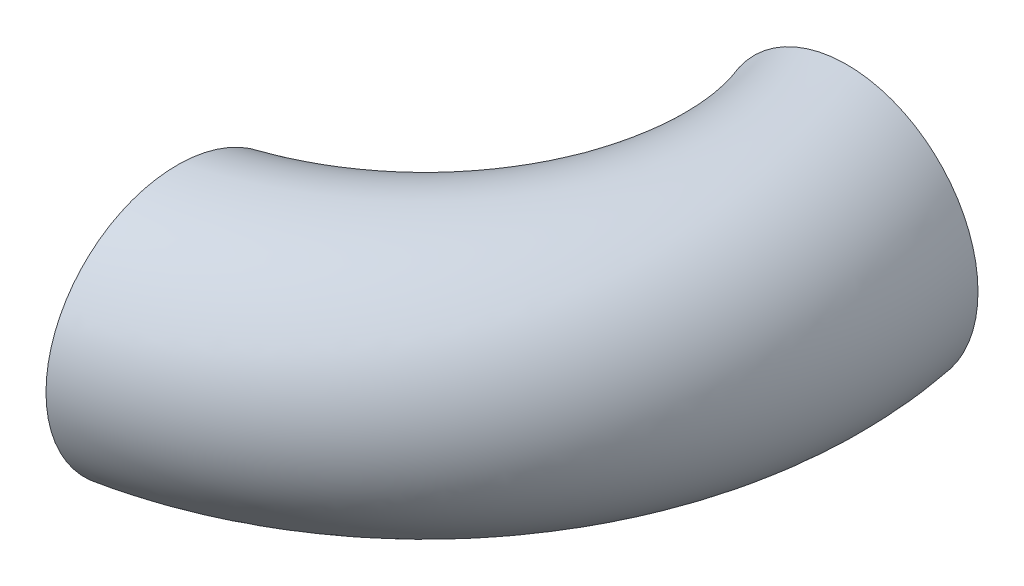
ISO-10303-21;
HEADER;
FILE_DESCRIPTION(('STEP AP214'),'2;1');
FILE_NAME('part.step','',(''),(''),'','','');
FILE_SCHEMA(('AUTOMOTIVE_DESIGN { 1 0 10303 214 1 1 1 1 }'));
ENDSEC;
DATA;
#1=APPLICATION_CONTEXT('core data for automotive mechanical design processes');
#2=APPLICATION_PROTOCOL_DEFINITION('international standard','automotive_design',2000,#1);
#3=PRODUCT_CONTEXT('',#1,'mechanical');
#4=PRODUCT('Part','Part','',(#3));
#5=PRODUCT_RELATED_PRODUCT_CATEGORY('part','',(#4));
#6=PRODUCT_DEFINITION_FORMATION('','',#4);
#7=PRODUCT_DEFINITION_CONTEXT('part definition',#1,'design');
#8=PRODUCT_DEFINITION('design','',#6,#7);
#9=PRODUCT_DEFINITION_SHAPE('','',#8);
#10=(LENGTH_UNIT() NAMED_UNIT(*) SI_UNIT(.MILLI.,.METRE.));
#11=(NAMED_UNIT(*) PLANE_ANGLE_UNIT() SI_UNIT($,.RADIAN.));
#12=(NAMED_UNIT(*) SI_UNIT($,.STERADIAN.) SOLID_ANGLE_UNIT());
#13=UNCERTAINTY_MEASURE_WITH_UNIT(LENGTH_MEASURE(1.E-05),#10,'distance_accuracy_value','');
#14=(GEOMETRIC_REPRESENTATION_CONTEXT(3) GLOBAL_UNCERTAINTY_ASSIGNED_CONTEXT((#13)) GLOBAL_UNIT_ASSIGNED_CONTEXT((#10,
#11,#12)) REPRESENTATION_CONTEXT('',''));
#15=CARTESIAN_POINT('',(0.,0.,0.));
#16=DIRECTION('',(0.,0.,1.));
#17=DIRECTION('',(1.,0.,0.));
#18=AXIS2_PLACEMENT_3D('',#15,#16,#17);
#19=CARTESIAN_POINT('',(-54.2116614614781,0.,92.3116614614781));
#20=DIRECTION('',(-1.,0.,0.));
#21=DIRECTION('',(0.,0.,1.));
#22=AXIS2_PLACEMENT_3D('',#19,#20,#21);
#23=CIRCLE('',#22,24.13);
#24=CARTESIAN_POINT('',(-73.2616614614781,0.,19.05));
#25=DIRECTION('',(0.,1.,0.));
#26=AXIS1_PLACEMENT('',#24,#25);
#27=SURFACE_OF_REVOLUTION('',#23,#26);
#28=CARTESIAN_POINT('',(-54.2116614614781,0.,116.441661461478));
#29=VERTEX_POINT('',#28);
#30=EDGE_CURVE('E41',#29,#29,#23,.T.);
#31=ORIENTED_EDGE('',*,*,#30,.T.);
#32=EDGE_LOOP('',(#31));
#33=FACE_BOUND('',#32,.T.);
#34=CARTESIAN_POINT('',(0.,0.,0.));
#35=DIRECTION('',(0.,0.,1.));
#36=DIRECTION('',(1.,0.,0.));
#37=AXIS2_PLACEMENT_3D('',#34,#35,#36);
#38=CIRCLE('',#37,24.13);
#39=CARTESIAN_POINT('',(24.13,0.,0.));
#40=VERTEX_POINT('',#39);
#41=EDGE_CURVE('E49',#40,#40,#38,.T.);
#42=ORIENTED_EDGE('',*,*,#41,.F.);
#43=EDGE_LOOP('',(#42));
#44=FACE_BOUND('',#43,.T.);
#45=ADVANCED_FACE('F33',(#33,#44),#27,.F.);
#46=CARTESIAN_POINT('',(-54.2116614614781,0.,92.3116614614781));
#47=DIRECTION('',(-1.,0.,0.));
#48=DIRECTION('',(0.,0.,1.));
#49=AXIS2_PLACEMENT_3D('',#46,#47,#48);
#50=CIRCLE('',#49,28.702);
#51=CARTESIAN_POINT('',(-73.2616614614781,0.,19.05));
#52=DIRECTION('',(0.,1.,0.));
#53=AXIS1_PLACEMENT('',#51,#52);
#54=SURFACE_OF_REVOLUTION('',#50,#53);
#55=CARTESIAN_POINT('',(-54.2116614614781,0.,121.013661461478));
#56=VERTEX_POINT('',#55);
#57=EDGE_CURVE('E10',#56,#56,#50,.T.);
#58=ORIENTED_EDGE('',*,*,#57,.F.);
#59=EDGE_LOOP('',(#58));
#60=FACE_BOUND('',#59,.T.);
#61=CARTESIAN_POINT('',(0.,0.,0.));
#62=DIRECTION('',(0.,0.,1.));
#63=DIRECTION('',(1.,0.,0.));
#64=AXIS2_PLACEMENT_3D('',#61,#62,#63);
#65=CIRCLE('',#64,28.702);
#66=CARTESIAN_POINT('',(28.702,0.,0.));
#67=VERTEX_POINT('',#66);
#68=EDGE_CURVE('E45',#67,#67,#65,.T.);
#69=ORIENTED_EDGE('',*,*,#68,.T.);
#70=EDGE_LOOP('',(#69));
#71=FACE_BOUND('',#70,.T.);
#72=ADVANCED_FACE('F35',(#60,#71),#54,.T.);
#73=CARTESIAN_POINT('',(-54.2116614614781,0.,92.3116614614781));
#74=DIRECTION('',(-1.,0.,0.));
#75=DIRECTION('',(0.,0.,1.));
#76=AXIS2_PLACEMENT_3D('',#73,#74,#75);
#77=PLANE('',#76);
#78=ORIENTED_EDGE('',*,*,#30,.F.);
#79=EDGE_LOOP('',(#78));
#80=FACE_BOUND('',#79,.T.);
#81=ORIENTED_EDGE('',*,*,#57,.T.);
#82=EDGE_LOOP('',(#81));
#83=FACE_BOUND('',#82,.T.);
#84=ADVANCED_FACE('F55',(#80,#83),#77,.T.);
#85=CARTESIAN_POINT('',(0.,0.,0.));
#86=DIRECTION('',(0.,0.,1.));
#87=DIRECTION('',(1.,0.,0.));
#88=AXIS2_PLACEMENT_3D('',#85,#86,#87);
#89=PLANE('',#88);
#90=ORIENTED_EDGE('',*,*,#41,.T.);
#91=EDGE_LOOP('',(#90));
#92=FACE_BOUND('',#91,.T.);
#93=ORIENTED_EDGE('',*,*,#68,.F.);
#94=EDGE_LOOP('',(#93));
#95=FACE_BOUND('',#94,.T.);
#96=ADVANCED_FACE('F58',(#92,#95),#89,.F.);
#97=CLOSED_SHELL('',(#45,#72,#84,#96));
#98=MANIFOLD_SOLID_BREP('B2',#97);
#99=ADVANCED_BREP_SHAPE_REPRESENTATION('',(#18,#98),#14);
#100=SHAPE_DEFINITION_REPRESENTATION(#9,#99);
ENDSEC;
END-ISO-10303-21;
